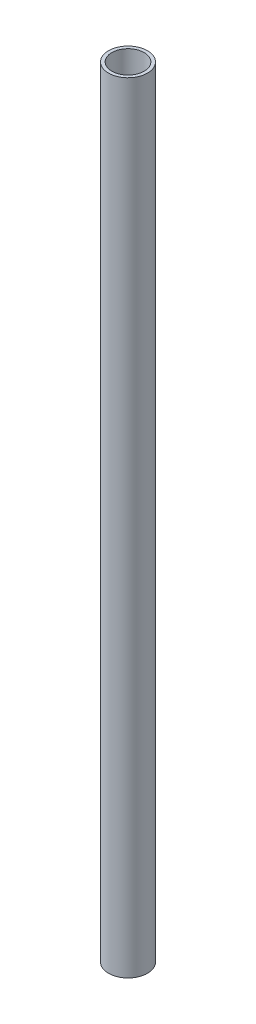
ISO-10303-21;
HEADER;
FILE_DESCRIPTION(('STEP AP214'),'2;1');
FILE_NAME('part.step','',(''),(''),'','','');
FILE_SCHEMA(('AUTOMOTIVE_DESIGN { 1 0 10303 214 1 1 1 1 }'));
ENDSEC;
DATA;
#1=APPLICATION_CONTEXT('core data for automotive mechanical design processes');
#2=APPLICATION_PROTOCOL_DEFINITION('international standard','automotive_design',2000,#1);
#3=PRODUCT_CONTEXT('',#1,'mechanical');
#4=PRODUCT('Part','Part','',(#3));
#5=PRODUCT_RELATED_PRODUCT_CATEGORY('part','',(#4));
#6=PRODUCT_DEFINITION_FORMATION('','',#4);
#7=PRODUCT_DEFINITION_CONTEXT('part definition',#1,'design');
#8=PRODUCT_DEFINITION('design','',#6,#7);
#9=PRODUCT_DEFINITION_SHAPE('','',#8);
#10=(LENGTH_UNIT() NAMED_UNIT(*) SI_UNIT(.MILLI.,.METRE.));
#11=(NAMED_UNIT(*) PLANE_ANGLE_UNIT() SI_UNIT($,.RADIAN.));
#12=(NAMED_UNIT(*) SI_UNIT($,.STERADIAN.) SOLID_ANGLE_UNIT());
#13=UNCERTAINTY_MEASURE_WITH_UNIT(LENGTH_MEASURE(1.E-05),#10,'distance_accuracy_value','');
#14=(GEOMETRIC_REPRESENTATION_CONTEXT(3) GLOBAL_UNCERTAINTY_ASSIGNED_CONTEXT((#13)) GLOBAL_UNIT_ASSIGNED_CONTEXT((#10,
#11,#12)) REPRESENTATION_CONTEXT('',''));
#15=CARTESIAN_POINT('',(0.,0.,0.));
#16=DIRECTION('',(0.,0.,1.));
#17=DIRECTION('',(1.,0.,0.));
#18=AXIS2_PLACEMENT_3D('',#15,#16,#17);
#19=CARTESIAN_POINT('',(0.,844.55,0.));
#20=DIRECTION('',(0.,1.,0.));
#21=DIRECTION('',(0.,0.,1.));
#22=AXIS2_PLACEMENT_3D('',#19,#20,#21);
#23=PLANE('',#22);
#24=CARTESIAN_POINT('',(0.,844.55,0.));
#25=DIRECTION('',(0.,1.,0.));
#26=DIRECTION('',(0.,0.,1.));
#27=AXIS2_PLACEMENT_3D('',#24,#25,#26);
#28=CIRCLE('',#27,21.082);
#29=CARTESIAN_POINT('',(0.,844.55,21.082));
#30=VERTEX_POINT('',#29);
#31=EDGE_CURVE('E10',#30,#30,#28,.T.);
#32=ORIENTED_EDGE('',*,*,#31,.T.);
#33=EDGE_LOOP('',(#32));
#34=FACE_BOUND('',#33,.T.);
#35=CARTESIAN_POINT('',(0.,844.55,0.));
#36=DIRECTION('',(0.,1.,0.));
#37=DIRECTION('',(0.,0.,1.));
#38=AXIS2_PLACEMENT_3D('',#35,#36,#37);
#39=CIRCLE('',#38,17.526);
#40=CARTESIAN_POINT('',(0.,844.55,17.526));
#41=VERTEX_POINT('',#40);
#42=EDGE_CURVE('E43',#41,#41,#39,.T.);
#43=ORIENTED_EDGE('',*,*,#42,.F.);
#44=EDGE_LOOP('',(#43));
#45=FACE_BOUND('',#44,.T.);
#46=ADVANCED_FACE('F32',(#34,#45),#23,.T.);
#47=CARTESIAN_POINT('',(0.,0.,0.));
#48=DIRECTION('',(0.,1.,0.));
#49=DIRECTION('',(0.,0.,1.));
#50=AXIS2_PLACEMENT_3D('',#47,#48,#49);
#51=PLANE('',#50);
#52=CARTESIAN_POINT('',(0.,0.,0.));
#53=DIRECTION('',(0.,1.,0.));
#54=DIRECTION('',(0.,0.,1.));
#55=AXIS2_PLACEMENT_3D('',#52,#53,#54);
#56=CIRCLE('',#55,21.082);
#57=CARTESIAN_POINT('',(0.,0.,21.082));
#58=VERTEX_POINT('',#57);
#59=EDGE_CURVE('E36',#58,#58,#56,.T.);
#60=ORIENTED_EDGE('',*,*,#59,.F.);
#61=EDGE_LOOP('',(#60));
#62=FACE_BOUND('',#61,.T.);
#63=CARTESIAN_POINT('',(0.,0.,0.));
#64=DIRECTION('',(0.,1.,0.));
#65=DIRECTION('',(0.,0.,1.));
#66=AXIS2_PLACEMENT_3D('',#63,#64,#65);
#67=CIRCLE('',#66,17.526);
#68=CARTESIAN_POINT('',(0.,0.,17.526));
#69=VERTEX_POINT('',#68);
#70=EDGE_CURVE('E45',#69,#69,#67,.T.);
#71=ORIENTED_EDGE('',*,*,#70,.T.);
#72=EDGE_LOOP('',(#71));
#73=FACE_BOUND('',#72,.T.);
#74=ADVANCED_FACE('F55',(#62,#73),#51,.F.);
#75=CARTESIAN_POINT('',(0.,844.55,0.));
#76=DIRECTION('',(0.,-1.,0.));
#77=DIRECTION('',(0.,0.,-1.));
#78=AXIS2_PLACEMENT_3D('',#75,#76,#77);
#79=CYLINDRICAL_SURFACE('',#78,21.082);
#80=ORIENTED_EDGE('',*,*,#31,.F.);
#81=EDGE_LOOP('',(#80));
#82=FACE_BOUND('',#81,.T.);
#83=ORIENTED_EDGE('',*,*,#59,.T.);
#84=EDGE_LOOP('',(#83));
#85=FACE_BOUND('',#84,.T.);
#86=ADVANCED_FACE('F34',(#82,#85),#79,.T.);
#87=CARTESIAN_POINT('',(0.,844.55,0.));
#88=DIRECTION('',(0.,-1.,0.));
#89=DIRECTION('',(0.,0.,-1.));
#90=AXIS2_PLACEMENT_3D('',#87,#88,#89);
#91=CYLINDRICAL_SURFACE('',#90,17.526);
#92=ORIENTED_EDGE('',*,*,#42,.T.);
#93=EDGE_LOOP('',(#92));
#94=FACE_BOUND('',#93,.T.);
#95=ORIENTED_EDGE('',*,*,#70,.F.);
#96=EDGE_LOOP('',(#95));
#97=FACE_BOUND('',#96,.T.);
#98=ADVANCED_FACE('F51',(#94,#97),#91,.F.);
#99=CLOSED_SHELL('',(#46,#74,#86,#98));
#100=MANIFOLD_SOLID_BREP('B2',#99);
#101=ADVANCED_BREP_SHAPE_REPRESENTATION('',(#18,#100),#14);
#102=SHAPE_DEFINITION_REPRESENTATION(#9,#101);
ENDSEC;
END-ISO-10303-21;
